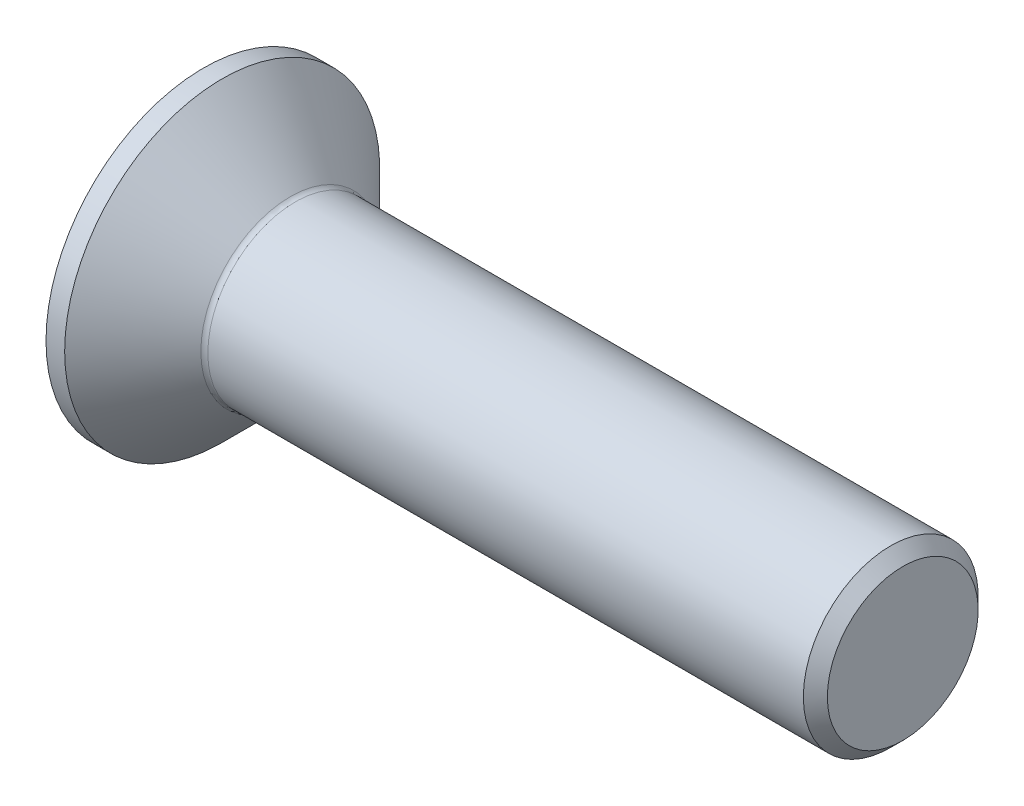
ISO-10303-21;
HEADER;
FILE_DESCRIPTION(('STEP AP214'),'2;1');
FILE_NAME('part.step','',(''),(''),'','','');
FILE_SCHEMA(('AUTOMOTIVE_DESIGN { 1 0 10303 214 1 1 1 1 }'));
ENDSEC;
DATA;
#1=APPLICATION_CONTEXT('core data for automotive mechanical design processes');
#2=APPLICATION_PROTOCOL_DEFINITION('international standard','automotive_design',2000,#1);
#3=PRODUCT_CONTEXT('',#1,'mechanical');
#4=PRODUCT('Part','Part','',(#3));
#5=PRODUCT_RELATED_PRODUCT_CATEGORY('part','',(#4));
#6=PRODUCT_DEFINITION_FORMATION('','',#4);
#7=PRODUCT_DEFINITION_CONTEXT('part definition',#1,'design');
#8=PRODUCT_DEFINITION('design','',#6,#7);
#9=PRODUCT_DEFINITION_SHAPE('','',#8);
#10=(LENGTH_UNIT() NAMED_UNIT(*) SI_UNIT(.MILLI.,.METRE.));
#11=(NAMED_UNIT(*) PLANE_ANGLE_UNIT() SI_UNIT($,.RADIAN.));
#12=(NAMED_UNIT(*) SI_UNIT($,.STERADIAN.) SOLID_ANGLE_UNIT());
#13=UNCERTAINTY_MEASURE_WITH_UNIT(LENGTH_MEASURE(1.E-05),#10,'distance_accuracy_value','');
#14=(GEOMETRIC_REPRESENTATION_CONTEXT(3) GLOBAL_UNCERTAINTY_ASSIGNED_CONTEXT((#13)) GLOBAL_UNIT_ASSIGNED_CONTEXT((#10,
#11,#12)) REPRESENTATION_CONTEXT('',''));
#15=CARTESIAN_POINT('',(0.,0.,0.));
#16=DIRECTION('',(0.,0.,1.));
#17=DIRECTION('',(1.,0.,0.));
#18=AXIS2_PLACEMENT_3D('',#15,#16,#17);
#19=CARTESIAN_POINT('',(0.,0.,0.));
#20=DIRECTION('',(-1.,0.,0.));
#21=DIRECTION('',(0.,0.,1.));
#22=AXIS2_PLACEMENT_3D('',#19,#20,#21);
#23=PLANE('',#22);
#24=CARTESIAN_POINT('',(0.,0.,0.));
#25=DIRECTION('',(-1.,0.,0.));
#26=DIRECTION('',(0.,0.,1.));
#27=AXIS2_PLACEMENT_3D('',#24,#25,#26);
#28=CIRCLE('',#27,18.025);
#29=CARTESIAN_POINT('',(0.,0.,18.025));
#30=VERTEX_POINT('',#29);
#31=EDGE_CURVE('E152',#30,#30,#28,.T.);
#32=ORIENTED_EDGE('',*,*,#31,.T.);
#33=EDGE_LOOP('',(#32));
#34=FACE_BOUND('',#33,.T.);
#35=DIRECTION('',(0.,-0.499999999999999,-0.866025403784439));
#36=VECTOR('',#35,1.);
#37=CARTESIAN_POINT('',(0.,-3.46410161513775,6.));
#38=LINE('',#37,#36);
#39=CARTESIAN_POINT('',(0.,-3.46410161513775,6.));
#40=VERTEX_POINT('',#39);
#41=CARTESIAN_POINT('',(0.,-6.92820323027551,0.));
#42=VERTEX_POINT('',#41);
#43=EDGE_CURVE('E118',#40,#42,#38,.T.);
#44=ORIENTED_EDGE('',*,*,#43,.T.);
#45=DIRECTION('',(0.,0.5,-0.866025403784439));
#46=VECTOR('',#45,1.);
#47=CARTESIAN_POINT('',(0.,-6.9282032302755,0.));
#48=LINE('',#47,#46);
#49=CARTESIAN_POINT('',(0.,-3.46410161513775,-6.));
#50=VERTEX_POINT('',#49);
#51=EDGE_CURVE('E49',#42,#50,#48,.T.);
#52=ORIENTED_EDGE('',*,*,#51,.T.);
#53=DIRECTION('',(0.,1.,0.));
#54=VECTOR('',#53,1.);
#55=CARTESIAN_POINT('',(0.,-3.46410161513775,-6.));
#56=LINE('',#55,#54);
#57=CARTESIAN_POINT('',(0.,3.46410161513776,-6.));
#58=VERTEX_POINT('',#57);
#59=EDGE_CURVE('E129',#50,#58,#56,.T.);
#60=ORIENTED_EDGE('',*,*,#59,.T.);
#61=DIRECTION('',(0.,0.5,0.866025403784439));
#62=VECTOR('',#61,1.);
#63=CARTESIAN_POINT('',(0.,3.46410161513776,-6.));
#64=LINE('',#63,#62);
#65=CARTESIAN_POINT('',(0.,6.92820323027551,0.));
#66=VERTEX_POINT('',#65);
#67=EDGE_CURVE('E253',#58,#66,#64,.T.);
#68=ORIENTED_EDGE('',*,*,#67,.T.);
#69=DIRECTION('',(0.,-0.5,0.866025403784439));
#70=VECTOR('',#69,1.);
#71=CARTESIAN_POINT('',(0.,6.92820323027551,0.));
#72=LINE('',#71,#70);
#73=CARTESIAN_POINT('',(0.,3.46410161513776,6.));
#74=VERTEX_POINT('',#73);
#75=EDGE_CURVE('E256',#66,#74,#72,.T.);
#76=ORIENTED_EDGE('',*,*,#75,.T.);
#77=DIRECTION('',(0.,-1.,0.));
#78=VECTOR('',#77,1.);
#79=CARTESIAN_POINT('',(0.,3.46410161513776,6.));
#80=LINE('',#79,#78);
#81=EDGE_CURVE('E259',#74,#40,#80,.T.);
#82=ORIENTED_EDGE('',*,*,#81,.T.);
#83=EDGE_LOOP('',(#44,#52,#60,#68,#76,#82));
#84=FACE_BOUND('',#83,.T.);
#85=ADVANCED_FACE('F34',(#34,#84),#23,.T.);
#86=CARTESIAN_POINT('',(0.,0.,0.));
#87=DIRECTION('',(-1.,0.,0.));
#88=DIRECTION('',(0.,0.,1.));
#89=AXIS2_PLACEMENT_3D('',#86,#87,#88);
#90=CYLINDRICAL_SURFACE('',#89,18.025);
#91=CARTESIAN_POINT('',(2.13500000000003,0.,0.));
#92=DIRECTION('',(-1.,0.,0.));
#93=DIRECTION('',(0.,0.,1.));
#94=AXIS2_PLACEMENT_3D('',#91,#92,#93);
#95=CIRCLE('',#94,18.025);
#96=CARTESIAN_POINT('',(2.13500000000003,0.,18.025));
#97=VERTEX_POINT('',#96);
#98=EDGE_CURVE('E149',#97,#97,#95,.T.);
#99=ORIENTED_EDGE('',*,*,#98,.T.);
#100=EDGE_LOOP('',(#99));
#101=FACE_BOUND('',#100,.T.);
#102=ORIENTED_EDGE('',*,*,#31,.F.);
#103=EDGE_LOOP('',(#102));
#104=FACE_BOUND('',#103,.T.);
#105=ADVANCED_FACE('F173',(#101,#104),#90,.T.);
#106=CARTESIAN_POINT('',(2.13500000000003,0.,0.));
#107=DIRECTION('',(-1.,0.,0.));
#108=DIRECTION('',(0.,0.,1.));
#109=AXIS2_PLACEMENT_3D('',#106,#107,#108);
#110=CONICAL_SURFACE('',#109,18.025,0.78539816339745);
#111=CARTESIAN_POINT('',(9.92568542494924,0.,0.));
#112=DIRECTION('',(-1.,0.,0.));
#113=DIRECTION('',(0.,0.,1.));
#114=AXIS2_PLACEMENT_3D('',#111,#112,#113);
#115=CIRCLE('',#114,10.2343145750508);
#116=CARTESIAN_POINT('',(9.92568542494924,0.,10.2343145750508));
#117=VERTEX_POINT('',#116);
#118=EDGE_CURVE('E42',#117,#117,#115,.T.);
#119=ORIENTED_EDGE('',*,*,#118,.T.);
#120=EDGE_LOOP('',(#119));
#121=FACE_BOUND('',#120,.T.);
#122=ORIENTED_EDGE('',*,*,#98,.F.);
#123=EDGE_LOOP('',(#122));
#124=FACE_BOUND('',#123,.T.);
#125=ADVANCED_FACE('F157',(#121,#124),#110,.T.);
#126=CARTESIAN_POINT('',(0.,0.,0.));
#127=DIRECTION('',(-1.,0.,0.));
#128=DIRECTION('',(0.,0.,1.));
#129=AXIS2_PLACEMENT_3D('',#126,#127,#128);
#130=CYLINDRICAL_SURFACE('',#129,10.);
#131=CARTESIAN_POINT('',(10.4913708498985,0.,0.));
#132=DIRECTION('',(-1.,0.,0.));
#133=DIRECTION('',(0.,0.,1.));
#134=AXIS2_PLACEMENT_3D('',#131,#132,#133);
#135=CIRCLE('',#134,10.);
#136=CARTESIAN_POINT('',(10.4913708498985,0.,10.));
#137=VERTEX_POINT('',#136);
#138=EDGE_CURVE('E11',#137,#137,#135,.F.);
#139=ORIENTED_EDGE('',*,*,#138,.T.);
#140=EDGE_LOOP('',(#139));
#141=FACE_BOUND('',#140,.T.);
#142=CARTESIAN_POINT('',(78.6259999999994,0.,0.));
#143=DIRECTION('',(-1.,0.,0.));
#144=DIRECTION('',(0.,0.,1.));
#145=AXIS2_PLACEMENT_3D('',#142,#143,#144);
#146=CIRCLE('',#145,10.);
#147=CARTESIAN_POINT('',(78.6259999999994,0.,10.));
#148=VERTEX_POINT('',#147);
#149=EDGE_CURVE('E146',#148,#148,#146,.T.);
#150=ORIENTED_EDGE('',*,*,#149,.T.);
#151=EDGE_LOOP('',(#150));
#152=FACE_BOUND('',#151,.T.);
#153=ADVANCED_FACE('F184',(#141,#152),#130,.T.);
#154=CARTESIAN_POINT('',(80.,0.,0.));
#155=DIRECTION('',(-1.,0.,0.));
#156=DIRECTION('',(0.,0.,1.));
#157=AXIS2_PLACEMENT_3D('',#154,#155,#156);
#158=CONICAL_SURFACE('',#157,8.626,0.785398163397231);
#159=ORIENTED_EDGE('',*,*,#149,.F.);
#160=EDGE_LOOP('',(#159));
#161=FACE_BOUND('',#160,.T.);
#162=CARTESIAN_POINT('',(80.,0.,0.));
#163=DIRECTION('',(-1.,0.,0.));
#164=DIRECTION('',(0.,0.,1.));
#165=AXIS2_PLACEMENT_3D('',#162,#163,#164);
#166=CIRCLE('',#165,8.626);
#167=CARTESIAN_POINT('',(80.,0.,8.626));
#168=VERTEX_POINT('',#167);
#169=EDGE_CURVE('E142',#168,#168,#166,.T.);
#170=ORIENTED_EDGE('',*,*,#169,.T.);
#171=EDGE_LOOP('',(#170));
#172=FACE_BOUND('',#171,.T.);
#173=ADVANCED_FACE('F168',(#161,#172),#158,.T.);
#174=CARTESIAN_POINT('',(80.,8.626,0.));
#175=DIRECTION('',(1.,0.,0.));
#176=DIRECTION('',(0.,0.,-1.));
#177=AXIS2_PLACEMENT_3D('',#174,#175,#176);
#178=PLANE('',#177);
#179=ORIENTED_EDGE('',*,*,#169,.F.);
#180=EDGE_LOOP('',(#179));
#181=FACE_BOUND('',#180,.T.);
#182=ADVANCED_FACE('F161',(#181),#178,.T.);
#183=CARTESIAN_POINT('',(10.4913708498985,0.,0.));
#184=DIRECTION('',(-1.,0.,0.));
#185=DIRECTION('',(0.,0.,1.));
#186=AXIS2_PLACEMENT_3D('',#183,#184,#185);
#187=TOROIDAL_SURFACE('',#186,10.8,0.8);
#188=ORIENTED_EDGE('',*,*,#138,.F.);
#189=EDGE_LOOP('',(#188));
#190=FACE_BOUND('',#189,.T.);
#191=ORIENTED_EDGE('',*,*,#118,.F.);
#192=EDGE_LOOP('',(#191));
#193=FACE_BOUND('',#192,.T.);
#194=ADVANCED_FACE('F36',(#190,#193),#187,.F.);
#195=CARTESIAN_POINT('',(5.6,-6.9282032302755,0.));
#196=DIRECTION('',(0.,0.866025403784439,0.5));
#197=DIRECTION('',(0.,-0.5,0.866025403784439));
#198=AXIS2_PLACEMENT_3D('',#195,#196,#197);
#199=PLANE('',#198);
#200=ORIENTED_EDGE('',*,*,#51,.F.);
#201=DIRECTION('',(-1.,0.,0.));
#202=VECTOR('',#201,1.);
#203=CARTESIAN_POINT('',(5.6,-6.9282032302755,0.));
#204=LINE('',#203,#202);
#205=CARTESIAN_POINT('',(5.6,-6.9282032302755,0.));
#206=VERTEX_POINT('',#205);
#207=EDGE_CURVE('E250',#206,#42,#204,.T.);
#208=ORIENTED_EDGE('',*,*,#207,.F.);
#209=DIRECTION('',(0.,0.5,-0.866025403784439));
#210=VECTOR('',#209,1.);
#211=CARTESIAN_POINT('',(5.6,-6.9282032302755,0.));
#212=LINE('',#211,#210);
#213=CARTESIAN_POINT('',(5.6,-5.19615242270663,-3.));
#214=VERTEX_POINT('',#213);
#215=EDGE_CURVE('E114',#206,#214,#212,.T.);
#216=ORIENTED_EDGE('',*,*,#215,.T.);
#217=CARTESIAN_POINT('',(5.6,-3.46410161513775,-6.));
#218=VERTEX_POINT('',#217);
#219=EDGE_CURVE('E110',#214,#218,#212,.T.);
#220=ORIENTED_EDGE('',*,*,#219,.T.);
#221=DIRECTION('',(-1.,0.,0.));
#222=VECTOR('',#221,1.);
#223=CARTESIAN_POINT('',(5.6,-3.46410161513775,-6.));
#224=LINE('',#223,#222);
#225=EDGE_CURVE('E112',#218,#50,#224,.T.);
#226=ORIENTED_EDGE('',*,*,#225,.T.);
#227=EDGE_LOOP('',(#200,#208,#216,#220,#226));
#228=FACE_BOUND('',#227,.T.);
#229=ADVANCED_FACE('F111',(#228),#199,.T.);
#230=CARTESIAN_POINT('',(5.6,-3.46410161513775,-6.));
#231=DIRECTION('',(0.,0.,1.));
#232=DIRECTION('',(0.,-1.,0.));
#233=AXIS2_PLACEMENT_3D('',#230,#231,#232);
#234=PLANE('',#233);
#235=ORIENTED_EDGE('',*,*,#59,.F.);
#236=ORIENTED_EDGE('',*,*,#225,.F.);
#237=DIRECTION('',(0.,1.,0.));
#238=VECTOR('',#237,1.);
#239=CARTESIAN_POINT('',(5.6,-3.46410161513775,-6.));
#240=LINE('',#239,#238);
#241=CARTESIAN_POINT('',(5.6,0.,-6.));
#242=VERTEX_POINT('',#241);
#243=EDGE_CURVE('E57',#218,#242,#240,.T.);
#244=ORIENTED_EDGE('',*,*,#243,.T.);
#245=CARTESIAN_POINT('',(5.6,3.46410161513776,-6.));
#246=VERTEX_POINT('',#245);
#247=EDGE_CURVE('E124',#242,#246,#240,.T.);
#248=ORIENTED_EDGE('',*,*,#247,.T.);
#249=DIRECTION('',(-1.,0.,0.));
#250=VECTOR('',#249,1.);
#251=CARTESIAN_POINT('',(5.6,3.46410161513776,-6.));
#252=LINE('',#251,#250);
#253=EDGE_CURVE('E131',#246,#58,#252,.T.);
#254=ORIENTED_EDGE('',*,*,#253,.T.);
#255=EDGE_LOOP('',(#235,#236,#244,#248,#254));
#256=FACE_BOUND('',#255,.T.);
#257=ADVANCED_FACE('F126',(#256),#234,.T.);
#258=CARTESIAN_POINT('',(5.6,3.46410161513776,-6.));
#259=DIRECTION('',(0.,-0.866025403784439,0.5));
#260=DIRECTION('',(0.,-0.5,-0.866025403784439));
#261=AXIS2_PLACEMENT_3D('',#258,#259,#260);
#262=PLANE('',#261);
#263=ORIENTED_EDGE('',*,*,#67,.F.);
#264=ORIENTED_EDGE('',*,*,#253,.F.);
#265=DIRECTION('',(0.,0.5,0.866025403784439));
#266=VECTOR('',#265,1.);
#267=CARTESIAN_POINT('',(5.6,3.46410161513776,-6.));
#268=LINE('',#267,#266);
#269=CARTESIAN_POINT('',(5.6,5.19615242270663,-3.));
#270=VERTEX_POINT('',#269);
#271=EDGE_CURVE('E231',#246,#270,#268,.T.);
#272=ORIENTED_EDGE('',*,*,#271,.T.);
#273=CARTESIAN_POINT('',(5.6,6.92820323027551,0.));
#274=VERTEX_POINT('',#273);
#275=EDGE_CURVE('E123',#270,#274,#268,.T.);
#276=ORIENTED_EDGE('',*,*,#275,.T.);
#277=DIRECTION('',(-1.,0.,0.));
#278=VECTOR('',#277,1.);
#279=CARTESIAN_POINT('',(5.6,6.92820323027551,0.));
#280=LINE('',#279,#278);
#281=EDGE_CURVE('E137',#274,#66,#280,.T.);
#282=ORIENTED_EDGE('',*,*,#281,.T.);
#283=EDGE_LOOP('',(#263,#264,#272,#276,#282));
#284=FACE_BOUND('',#283,.T.);
#285=ADVANCED_FACE('F198',(#284),#262,.T.);
#286=CARTESIAN_POINT('',(5.6,6.92820323027551,0.));
#287=DIRECTION('',(0.,-0.866025403784439,-0.5));
#288=DIRECTION('',(0.,0.5,-0.866025403784439));
#289=AXIS2_PLACEMENT_3D('',#286,#287,#288);
#290=PLANE('',#289);
#291=ORIENTED_EDGE('',*,*,#75,.F.);
#292=ORIENTED_EDGE('',*,*,#281,.F.);
#293=DIRECTION('',(0.,-0.5,0.866025403784439));
#294=VECTOR('',#293,1.);
#295=CARTESIAN_POINT('',(5.6,6.92820323027551,0.));
#296=LINE('',#295,#294);
#297=CARTESIAN_POINT('',(5.6,5.19615242270663,3.));
#298=VERTEX_POINT('',#297);
#299=EDGE_CURVE('E238',#274,#298,#296,.T.);
#300=ORIENTED_EDGE('',*,*,#299,.T.);
#301=CARTESIAN_POINT('',(5.6,3.46410161513776,6.));
#302=VERTEX_POINT('',#301);
#303=EDGE_CURVE('E236',#298,#302,#296,.T.);
#304=ORIENTED_EDGE('',*,*,#303,.T.);
#305=DIRECTION('',(-1.,0.,0.));
#306=VECTOR('',#305,1.);
#307=CARTESIAN_POINT('',(5.6,3.46410161513776,6.));
#308=LINE('',#307,#306);
#309=EDGE_CURVE('E268',#302,#74,#308,.T.);
#310=ORIENTED_EDGE('',*,*,#309,.T.);
#311=EDGE_LOOP('',(#291,#292,#300,#304,#310));
#312=FACE_BOUND('',#311,.T.);
#313=ADVANCED_FACE('F201',(#312),#290,.T.);
#314=CARTESIAN_POINT('',(5.6,3.46410161513776,6.));
#315=DIRECTION('',(0.,0.,-1.));
#316=DIRECTION('',(-1.,0.,0.));
#317=AXIS2_PLACEMENT_3D('',#314,#315,#316);
#318=PLANE('',#317);
#319=ORIENTED_EDGE('',*,*,#81,.F.);
#320=ORIENTED_EDGE('',*,*,#309,.F.);
#321=DIRECTION('',(0.,-1.,0.));
#322=VECTOR('',#321,1.);
#323=CARTESIAN_POINT('',(5.6,3.46410161513776,6.));
#324=LINE('',#323,#322);
#325=CARTESIAN_POINT('',(5.6,0.,6.));
#326=VERTEX_POINT('',#325);
#327=EDGE_CURVE('E243',#302,#326,#324,.T.);
#328=ORIENTED_EDGE('',*,*,#327,.T.);
#329=CARTESIAN_POINT('',(5.6,-3.46410161513775,6.));
#330=VERTEX_POINT('',#329);
#331=EDGE_CURVE('E242',#326,#330,#324,.T.);
#332=ORIENTED_EDGE('',*,*,#331,.T.);
#333=DIRECTION('',(-1.,0.,0.));
#334=VECTOR('',#333,1.);
#335=CARTESIAN_POINT('',(5.6,-3.46410161513775,6.));
#336=LINE('',#335,#334);
#337=EDGE_CURVE('E265',#330,#40,#336,.T.);
#338=ORIENTED_EDGE('',*,*,#337,.T.);
#339=EDGE_LOOP('',(#319,#320,#328,#332,#338));
#340=FACE_BOUND('',#339,.T.);
#341=ADVANCED_FACE('F205',(#340),#318,.T.);
#342=CARTESIAN_POINT('',(5.6,-3.46410161513775,6.));
#343=DIRECTION('',(0.,0.866025403784439,-0.5));
#344=DIRECTION('',(0.,0.5,0.866025403784439));
#345=AXIS2_PLACEMENT_3D('',#342,#343,#344);
#346=PLANE('',#345);
#347=ORIENTED_EDGE('',*,*,#43,.F.);
#348=ORIENTED_EDGE('',*,*,#337,.F.);
#349=DIRECTION('',(0.,-0.499999999999999,-0.866025403784439));
#350=VECTOR('',#349,1.);
#351=CARTESIAN_POINT('',(5.6,-3.46410161513775,6.));
#352=LINE('',#351,#350);
#353=CARTESIAN_POINT('',(5.6,-5.19615242270663,3.));
#354=VERTEX_POINT('',#353);
#355=EDGE_CURVE('E247',#330,#354,#352,.T.);
#356=ORIENTED_EDGE('',*,*,#355,.T.);
#357=EDGE_CURVE('E246',#354,#206,#352,.T.);
#358=ORIENTED_EDGE('',*,*,#357,.T.);
#359=ORIENTED_EDGE('',*,*,#207,.T.);
#360=EDGE_LOOP('',(#347,#348,#356,#358,#359));
#361=FACE_BOUND('',#360,.T.);
#362=ADVANCED_FACE('F209',(#361),#346,.T.);
#363=CARTESIAN_POINT('',(5.6,-3.46410161513775,-6.));
#364=DIRECTION('',(1.,0.,0.));
#365=DIRECTION('',(0.,0.,-1.));
#366=AXIS2_PLACEMENT_3D('',#363,#364,#365);
#367=PLANE('',#366);
#368=ORIENTED_EDGE('',*,*,#243,.F.);
#369=ORIENTED_EDGE('',*,*,#219,.F.);
#370=CARTESIAN_POINT('',(5.6,0.,0.));
#371=DIRECTION('',(-1.,0.,0.));
#372=DIRECTION('',(0.,0.,1.));
#373=AXIS2_PLACEMENT_3D('',#370,#371,#372);
#374=CIRCLE('',#373,6.);
#375=EDGE_CURVE('E121',#242,#214,#374,.T.);
#376=ORIENTED_EDGE('',*,*,#375,.F.);
#377=EDGE_LOOP('',(#368,#369,#376));
#378=FACE_BOUND('',#377,.T.);
#379=ADVANCED_FACE('F120',(#378),#367,.F.);
#380=ORIENTED_EDGE('',*,*,#215,.F.);
#381=ORIENTED_EDGE('',*,*,#357,.F.);
#382=EDGE_CURVE('E134',#214,#354,#374,.T.);
#383=ORIENTED_EDGE('',*,*,#382,.F.);
#384=EDGE_LOOP('',(#380,#381,#383));
#385=FACE_BOUND('',#384,.T.);
#386=ADVANCED_FACE('F215',(#385),#367,.F.);
#387=ORIENTED_EDGE('',*,*,#355,.F.);
#388=ORIENTED_EDGE('',*,*,#331,.F.);
#389=EDGE_CURVE('E130',#354,#326,#374,.T.);
#390=ORIENTED_EDGE('',*,*,#389,.F.);
#391=EDGE_LOOP('',(#387,#388,#390));
#392=FACE_BOUND('',#391,.T.);
#393=ADVANCED_FACE('F219',(#392),#367,.F.);
#394=ORIENTED_EDGE('',*,*,#327,.F.);
#395=ORIENTED_EDGE('',*,*,#303,.F.);
#396=EDGE_CURVE('E136',#326,#298,#374,.T.);
#397=ORIENTED_EDGE('',*,*,#396,.F.);
#398=EDGE_LOOP('',(#394,#395,#397));
#399=FACE_BOUND('',#398,.T.);
#400=ADVANCED_FACE('F227',(#399),#367,.F.);
#401=ORIENTED_EDGE('',*,*,#299,.F.);
#402=ORIENTED_EDGE('',*,*,#275,.F.);
#403=EDGE_CURVE('E143',#298,#270,#374,.T.);
#404=ORIENTED_EDGE('',*,*,#403,.F.);
#405=EDGE_LOOP('',(#401,#402,#404));
#406=FACE_BOUND('',#405,.T.);
#407=ADVANCED_FACE('F222',(#406),#367,.F.);
#408=ORIENTED_EDGE('',*,*,#271,.F.);
#409=ORIENTED_EDGE('',*,*,#247,.F.);
#410=EDGE_CURVE('E232',#270,#242,#374,.T.);
#411=ORIENTED_EDGE('',*,*,#410,.F.);
#412=EDGE_LOOP('',(#408,#409,#411));
#413=FACE_BOUND('',#412,.T.);
#414=ADVANCED_FACE('F193',(#413),#367,.F.);
#415=CARTESIAN_POINT('',(5.6,0.,0.));
#416=DIRECTION('',(-1.,0.,0.));
#417=DIRECTION('',(0.,0.,1.));
#418=AXIS2_PLACEMENT_3D('',#415,#416,#417);
#419=CONICAL_SURFACE('',#418,6.,1.04719755119659);
#420=CARTESIAN_POINT('',(9.06410161513779,0.,0.));
#421=VERTEX_POINT('',#420);
#422=VERTEX_LOOP('',#421);
#423=FACE_BOUND('',#422,.T.);
#424=ORIENTED_EDGE('',*,*,#396,.T.);
#425=ORIENTED_EDGE('',*,*,#403,.T.);
#426=ORIENTED_EDGE('',*,*,#410,.T.);
#427=ORIENTED_EDGE('',*,*,#375,.T.);
#428=ORIENTED_EDGE('',*,*,#382,.T.);
#429=ORIENTED_EDGE('',*,*,#389,.T.);
#430=EDGE_LOOP('',(#424,#425,#426,#427,#428,#429));
#431=FACE_BOUND('',#430,.T.);
#432=ADVANCED_FACE('F191',(#423,#431),#419,.F.);
#433=CLOSED_SHELL('',(#85,#105,#125,#153,#173,#182,#194,#229,#257,#285,#313,#341,#362,#379,#386,
#393,#400,#407,#414,#432));
#434=MANIFOLD_SOLID_BREP('B2',#433);
#435=ADVANCED_BREP_SHAPE_REPRESENTATION('',(#18,#434),#14);
#436=SHAPE_DEFINITION_REPRESENTATION(#9,#435);
ENDSEC;
END-ISO-10303-21;
